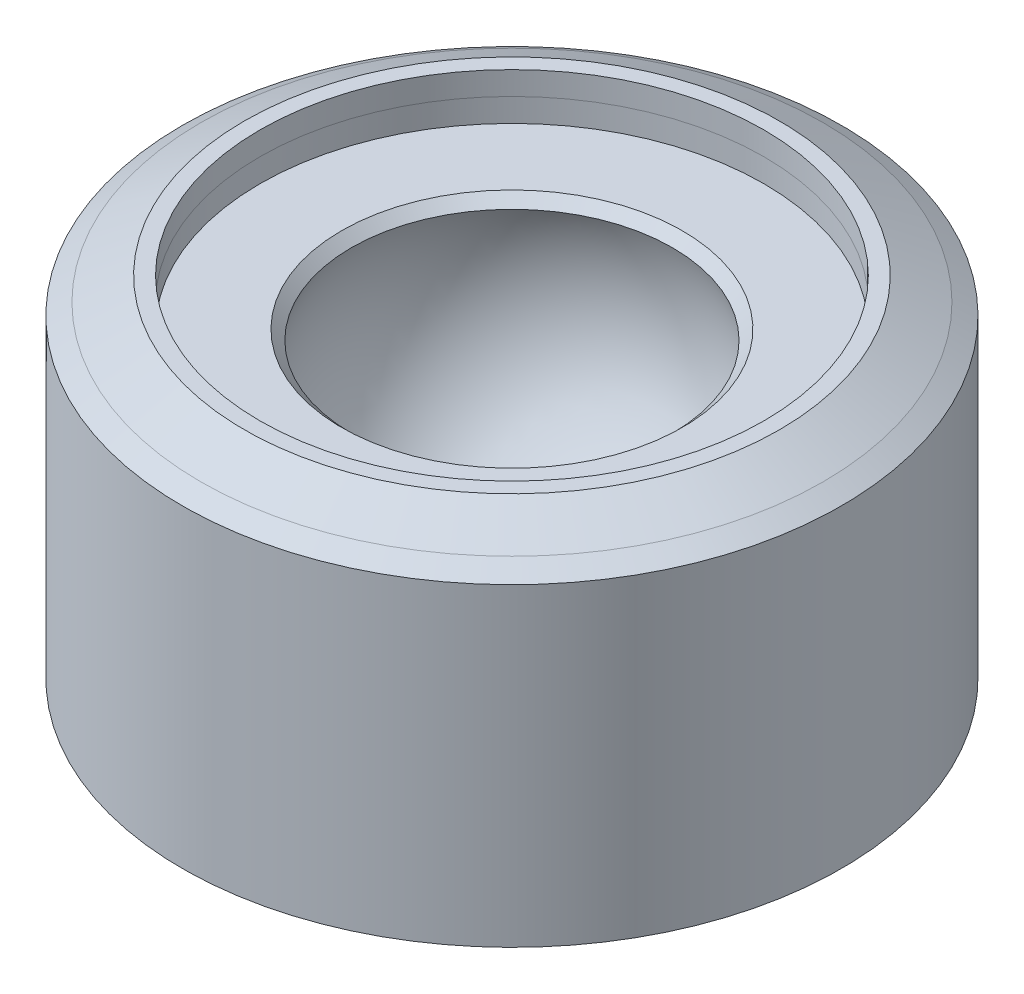
ISO-10303-21;
HEADER;
FILE_DESCRIPTION(('STEP AP214'),'2;1');
FILE_NAME('part.step','',(''),(''),'','','');
FILE_SCHEMA(('AUTOMOTIVE_DESIGN { 1 0 10303 214 1 1 1 1 }'));
ENDSEC;
DATA;
#1=APPLICATION_CONTEXT('core data for automotive mechanical design processes');
#2=APPLICATION_PROTOCOL_DEFINITION('international standard','automotive_design',2000,#1);
#3=PRODUCT_CONTEXT('',#1,'mechanical');
#4=PRODUCT('Part','Part','',(#3));
#5=PRODUCT_RELATED_PRODUCT_CATEGORY('part','',(#4));
#6=PRODUCT_DEFINITION_FORMATION('','',#4);
#7=PRODUCT_DEFINITION_CONTEXT('part definition',#1,'design');
#8=PRODUCT_DEFINITION('design','',#6,#7);
#9=PRODUCT_DEFINITION_SHAPE('','',#8);
#10=(LENGTH_UNIT() NAMED_UNIT(*) SI_UNIT(.MILLI.,.METRE.));
#11=(NAMED_UNIT(*) PLANE_ANGLE_UNIT() SI_UNIT($,.RADIAN.));
#12=(NAMED_UNIT(*) SI_UNIT($,.STERADIAN.) SOLID_ANGLE_UNIT());
#13=UNCERTAINTY_MEASURE_WITH_UNIT(LENGTH_MEASURE(1.E-05),#10,'distance_accuracy_value','');
#14=(GEOMETRIC_REPRESENTATION_CONTEXT(3) GLOBAL_UNCERTAINTY_ASSIGNED_CONTEXT((#13)) GLOBAL_UNIT_ASSIGNED_CONTEXT((#10,
#11,#12)) REPRESENTATION_CONTEXT('',''));
#15=CARTESIAN_POINT('',(0.,0.,0.));
#16=DIRECTION('',(0.,0.,1.));
#17=DIRECTION('',(1.,0.,0.));
#18=AXIS2_PLACEMENT_3D('',#15,#16,#17);
#19=CARTESIAN_POINT('',(12.9861612673409,10.3300407766649,0.));
#20=DIRECTION('',(0.,1.,0.));
#21=DIRECTION('',(1.,0.,0.));
#22=AXIS2_PLACEMENT_3D('',#19,#20,#21);
#23=SPHERICAL_SURFACE('',#22,22.477766792987);
#24=CARTESIAN_POINT('',(12.9861612673411,19.0652028049615,0.));
#25=DIRECTION('',(0.,1.,0.));
#26=DIRECTION('',(-1.,0.,0.));
#27=AXIS2_PLACEMENT_3D('',#24,#25,#26);
#28=CIRCLE('',#27,20.7110343618884);
#29=CARTESIAN_POINT('',(-7.72487309454726,19.0652028049615,0.));
#30=VERTEX_POINT('',#29);
#31=EDGE_CURVE('E10',#30,#30,#28,.T.);
#32=ORIENTED_EDGE('',*,*,#31,.T.);
#33=EDGE_LOOP('',(#32));
#34=FACE_BOUND('',#33,.T.);
#35=ADVANCED_FACE('F30',(#34),#23,.F.);
#36=CARTESIAN_POINT('',(12.9861612673411,19.0652028049615,0.));
#37=DIRECTION('',(0.,1.,0.));
#38=DIRECTION('',(-1.,0.,0.));
#39=AXIS2_PLACEMENT_3D('',#36,#37,#38);
#40=CONICAL_SURFACE('',#39,20.7110343618884,0.78594680293028);
#41=CARTESIAN_POINT('',(12.9861612673411,20.3300407766753,0.));
#42=DIRECTION('',(0.,1.,0.));
#43=DIRECTION('',(-1.,0.,0.));
#44=AXIS2_PLACEMENT_3D('',#41,#42,#43);
#45=CIRCLE('',#44,21.9772609758333);
#46=CARTESIAN_POINT('',(-8.99109970849216,20.3300407766753,0.));
#47=VERTEX_POINT('',#46);
#48=EDGE_CURVE('E36',#47,#47,#45,.T.);
#49=ORIENTED_EDGE('',*,*,#48,.T.);
#50=EDGE_LOOP('',(#49));
#51=FACE_BOUND('',#50,.T.);
#52=ORIENTED_EDGE('',*,*,#31,.F.);
#53=EDGE_LOOP('',(#52));
#54=FACE_BOUND('',#53,.T.);
#55=ADVANCED_FACE('F77',(#51,#54),#40,.F.);
#56=CARTESIAN_POINT('',(-19.4984504742162,20.3300407766749,0.));
#57=DIRECTION('',(0.,1.,0.));
#58=DIRECTION('',(-1.,0.,0.));
#59=AXIS2_PLACEMENT_3D('',#56,#57,#58);
#60=PLANE('',#59);
#61=CARTESIAN_POINT('',(12.9861612673411,20.3300407766746,0.));
#62=DIRECTION('',(0.,1.,0.));
#63=DIRECTION('',(-1.,0.,0.));
#64=AXIS2_PLACEMENT_3D('',#61,#62,#63);
#65=CIRCLE('',#64,32.4846117415573);
#66=CARTESIAN_POINT('',(-19.4984504742162,20.3300407766746,0.));
#67=VERTEX_POINT('',#66);
#68=EDGE_CURVE('E40',#67,#67,#65,.T.);
#69=ORIENTED_EDGE('',*,*,#68,.T.);
#70=EDGE_LOOP('',(#69));
#71=FACE_BOUND('',#70,.T.);
#72=ORIENTED_EDGE('',*,*,#48,.F.);
#73=EDGE_LOOP('',(#72));
#74=FACE_BOUND('',#73,.T.);
#75=ADVANCED_FACE('F81',(#71,#74),#60,.T.);
#76=CARTESIAN_POINT('',(12.9861612673411,20.3300407766746,0.));
#77=DIRECTION('',(0.,1.,0.));
#78=DIRECTION('',(-1.,0.,0.));
#79=AXIS2_PLACEMENT_3D('',#76,#77,#78);
#80=CONICAL_SURFACE('',#79,32.4846117415573,0.00512937449500175);
#81=CARTESIAN_POINT('',(12.9861612673411,23.3300407766746,0.));
#82=DIRECTION('',(0.,1.,0.));
#83=DIRECTION('',(-1.,0.,0.));
#84=AXIS2_PLACEMENT_3D('',#81,#82,#83);
#85=CIRCLE('',#84,32.5);
#86=CARTESIAN_POINT('',(-19.5138387326589,23.3300407766746,0.));
#87=VERTEX_POINT('',#86);
#88=EDGE_CURVE('E44',#87,#87,#85,.T.);
#89=ORIENTED_EDGE('',*,*,#88,.T.);
#90=EDGE_LOOP('',(#89));
#91=FACE_BOUND('',#90,.T.);
#92=ORIENTED_EDGE('',*,*,#68,.F.);
#93=EDGE_LOOP('',(#92));
#94=FACE_BOUND('',#93,.T.);
#95=ADVANCED_FACE('F85',(#91,#94),#80,.F.);
#96=CARTESIAN_POINT('',(12.9861612673411,-12.1477260163222,0.));
#97=DIRECTION('',(0.,1.,0.));
#98=DIRECTION('',(-1.,0.,0.));
#99=AXIS2_PLACEMENT_3D('',#96,#97,#98);
#100=CYLINDRICAL_SURFACE('',#99,32.5);
#101=CARTESIAN_POINT('',(12.9861612673411,26.3300407766746,0.));
#102=DIRECTION('',(0.,1.,0.));
#103=DIRECTION('',(-1.,0.,0.));
#104=AXIS2_PLACEMENT_3D('',#101,#102,#103);
#105=CIRCLE('',#104,32.5);
#106=CARTESIAN_POINT('',(-19.5138387326589,26.3300407766746,0.));
#107=VERTEX_POINT('',#106);
#108=EDGE_CURVE('E49',#107,#107,#105,.T.);
#109=ORIENTED_EDGE('',*,*,#108,.T.);
#110=EDGE_LOOP('',(#109));
#111=FACE_BOUND('',#110,.T.);
#112=ORIENTED_EDGE('',*,*,#88,.F.);
#113=EDGE_LOOP('',(#112));
#114=FACE_BOUND('',#113,.T.);
#115=ADVANCED_FACE('F92',(#111,#114),#100,.F.);
#116=CARTESIAN_POINT('',(-19.5138387326589,26.3300407766746,0.));
#117=DIRECTION('',(0.,1.,0.));
#118=DIRECTION('',(-1.,0.,0.));
#119=AXIS2_PLACEMENT_3D('',#116,#117,#118);
#120=PLANE('',#119);
#121=CARTESIAN_POINT('',(12.9861612673411,26.3300407766745,0.));
#122=DIRECTION('',(0.,1.,0.));
#123=DIRECTION('',(-1.,0.,0.));
#124=AXIS2_PLACEMENT_3D('',#121,#122,#123);
#125=CIRCLE('',#124,34.5);
#126=CARTESIAN_POINT('',(-21.5138387326589,26.3300407766745,0.));
#127=VERTEX_POINT('',#126);
#128=EDGE_CURVE('E52',#127,#127,#125,.T.);
#129=ORIENTED_EDGE('',*,*,#128,.T.);
#130=EDGE_LOOP('',(#129));
#131=FACE_BOUND('',#130,.T.);
#132=ORIENTED_EDGE('',*,*,#108,.F.);
#133=EDGE_LOOP('',(#132));
#134=FACE_BOUND('',#133,.T.);
#135=ADVANCED_FACE('F96',(#131,#134),#120,.T.);
#136=CARTESIAN_POINT('',(12.9861612673411,26.3300407766745,0.));
#137=DIRECTION('',(0.,-1.,0.));
#138=DIRECTION('',(1.,0.,0.));
#139=AXIS2_PLACEMENT_3D('',#136,#137,#138);
#140=CONICAL_SURFACE('',#139,34.5,1.08080501936055);
#141=CARTESIAN_POINT('',(12.9861612673411,23.3300407766745,0.));
#142=DIRECTION('',(0.,1.,0.));
#143=DIRECTION('',(-1.,0.,0.));
#144=AXIS2_PLACEMENT_3D('',#141,#142,#143);
#145=CIRCLE('',#144,40.1245396905221);
#146=CARTESIAN_POINT('',(-27.138378423181,23.3300407766746,0.));
#147=VERTEX_POINT('',#146);
#148=EDGE_CURVE('E55',#147,#147,#145,.T.);
#149=ORIENTED_EDGE('',*,*,#148,.T.);
#150=EDGE_LOOP('',(#149));
#151=FACE_BOUND('',#150,.T.);
#152=ORIENTED_EDGE('',*,*,#128,.F.);
#153=EDGE_LOOP('',(#152));
#154=FACE_BOUND('',#153,.T.);
#155=ADVANCED_FACE('F100',(#151,#154),#140,.T.);
#156=CARTESIAN_POINT('',(12.9861612673411,23.3300407766745,0.));
#157=DIRECTION('',(0.,-1.,0.));
#158=DIRECTION('',(1.,0.,0.));
#159=AXIS2_PLACEMENT_3D('',#156,#157,#158);
#160=CONICAL_SURFACE('',#159,40.1245396905221,1.00912705115901);
#161=CARTESIAN_POINT('',(12.9861612673411,21.8352173271078,0.));
#162=DIRECTION('',(0.,1.,0.));
#163=DIRECTION('',(-1.,0.,0.));
#164=AXIS2_PLACEMENT_3D('',#161,#162,#163);
#165=CIRCLE('',#164,42.5);
#166=CARTESIAN_POINT('',(-29.5138387326589,21.8352173271078,0.));
#167=VERTEX_POINT('',#166);
#168=EDGE_CURVE('E58',#167,#167,#165,.T.);
#169=ORIENTED_EDGE('',*,*,#168,.T.);
#170=EDGE_LOOP('',(#169));
#171=FACE_BOUND('',#170,.T.);
#172=ORIENTED_EDGE('',*,*,#148,.F.);
#173=EDGE_LOOP('',(#172));
#174=FACE_BOUND('',#173,.T.);
#175=ADVANCED_FACE('F74',(#171,#174),#160,.T.);
#176=CARTESIAN_POINT('',(12.9861612673411,-12.1477260163222,0.));
#177=DIRECTION('',(0.,1.,0.));
#178=DIRECTION('',(-1.,0.,0.));
#179=AXIS2_PLACEMENT_3D('',#176,#177,#178);
#180=CYLINDRICAL_SURFACE('',#179,42.5);
#181=CARTESIAN_POINT('',(12.9861612673411,-18.6699592233254,0.));
#182=DIRECTION('',(0.,1.,0.));
#183=DIRECTION('',(-1.,0.,0.));
#184=AXIS2_PLACEMENT_3D('',#181,#182,#183);
#185=CIRCLE('',#184,42.5);
#186=CARTESIAN_POINT('',(-29.5138387326589,-18.6699592233254,0.));
#187=VERTEX_POINT('',#186);
#188=EDGE_CURVE('E61',#187,#187,#185,.T.);
#189=ORIENTED_EDGE('',*,*,#188,.T.);
#190=EDGE_LOOP('',(#189));
#191=FACE_BOUND('',#190,.T.);
#192=ORIENTED_EDGE('',*,*,#168,.F.);
#193=EDGE_LOOP('',(#192));
#194=FACE_BOUND('',#193,.T.);
#195=ADVANCED_FACE('F65',(#191,#194),#180,.T.);
#196=CARTESIAN_POINT('',(-29.5138387326589,-18.6699592233254,0.));
#197=DIRECTION('',(0.,-1.,0.));
#198=DIRECTION('',(1.,0.,0.));
#199=AXIS2_PLACEMENT_3D('',#196,#197,#198);
#200=PLANE('',#199);
#201=ORIENTED_EDGE('',*,*,#188,.F.);
#202=EDGE_LOOP('',(#201));
#203=FACE_BOUND('',#202,.T.);
#204=ADVANCED_FACE('F68',(#203),#200,.T.);
#205=CLOSED_SHELL('',(#35,#55,#75,#95,#115,#135,#155,#175,#195,#204));
#206=MANIFOLD_SOLID_BREP('B2',#205);
#207=ADVANCED_BREP_SHAPE_REPRESENTATION('',(#18,#206),#14);
#208=SHAPE_DEFINITION_REPRESENTATION(#9,#207);
ENDSEC;
END-ISO-10303-21;
